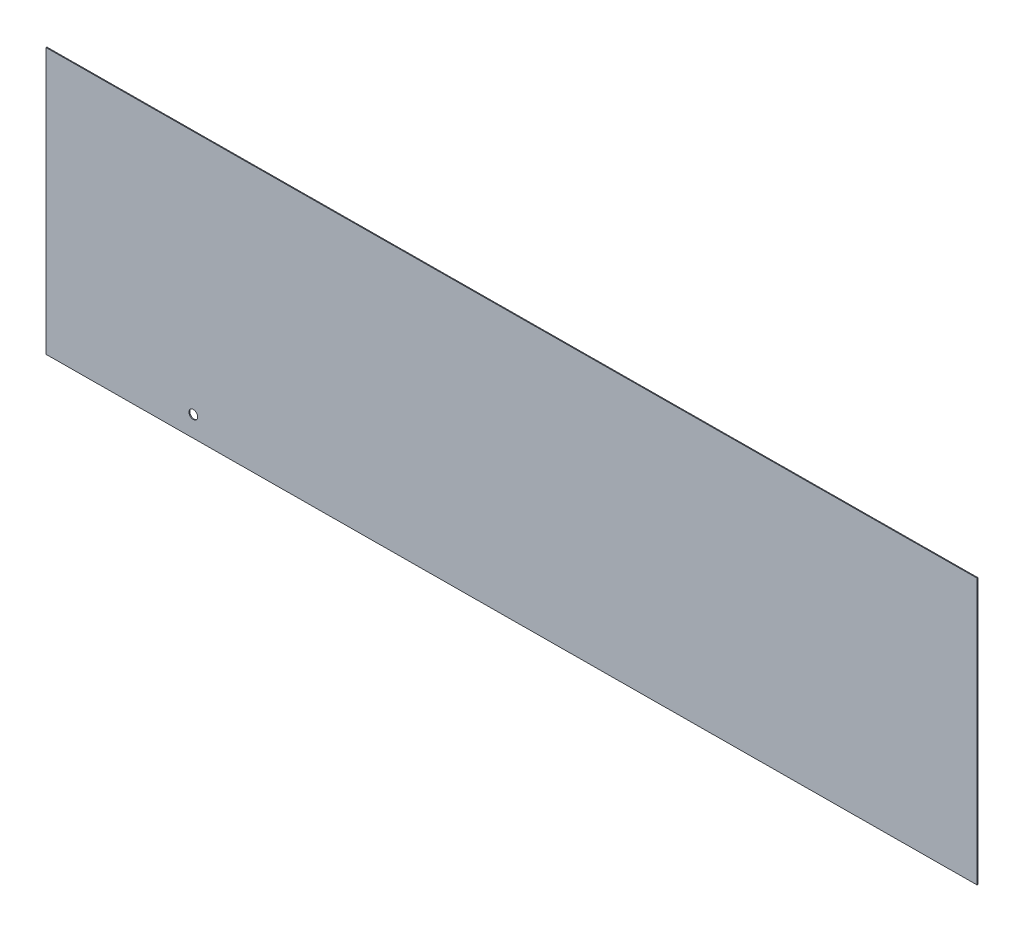
ISO-10303-21;
HEADER;
FILE_DESCRIPTION(('STEP AP214'),'2;1');
FILE_NAME('part.step','',(''),(''),'','','');
FILE_SCHEMA(('AUTOMOTIVE_DESIGN { 1 0 10303 214 1 1 1 1 }'));
ENDSEC;
DATA;
#1=APPLICATION_CONTEXT('core data for automotive mechanical design processes');
#2=APPLICATION_PROTOCOL_DEFINITION('international standard','automotive_design',2000,#1);
#3=PRODUCT_CONTEXT('',#1,'mechanical');
#4=PRODUCT('Part','Part','',(#3));
#5=PRODUCT_RELATED_PRODUCT_CATEGORY('part','',(#4));
#6=PRODUCT_DEFINITION_FORMATION('','',#4);
#7=PRODUCT_DEFINITION_CONTEXT('part definition',#1,'design');
#8=PRODUCT_DEFINITION('design','',#6,#7);
#9=PRODUCT_DEFINITION_SHAPE('','',#8);
#10=(LENGTH_UNIT() NAMED_UNIT(*) SI_UNIT(.MILLI.,.METRE.));
#11=(NAMED_UNIT(*) PLANE_ANGLE_UNIT() SI_UNIT($,.RADIAN.));
#12=(NAMED_UNIT(*) SI_UNIT($,.STERADIAN.) SOLID_ANGLE_UNIT());
#13=UNCERTAINTY_MEASURE_WITH_UNIT(LENGTH_MEASURE(1.E-05),#10,'distance_accuracy_value','');
#14=(GEOMETRIC_REPRESENTATION_CONTEXT(3) GLOBAL_UNCERTAINTY_ASSIGNED_CONTEXT((#13)) GLOBAL_UNIT_ASSIGNED_CONTEXT((#10,
#11,#12)) REPRESENTATION_CONTEXT('',''));
#15=CARTESIAN_POINT('',(0.,0.,0.));
#16=DIRECTION('',(0.,0.,1.));
#17=DIRECTION('',(1.,0.,0.));
#18=AXIS2_PLACEMENT_3D('',#15,#16,#17);
#19=CARTESIAN_POINT('',(-4.99352331606251,731.,-770.983829094289));
#20=DIRECTION('',(0.999979026062632,0.,-0.00647668393782393));
#21=DIRECTION('',(0.,1.,0.));
#22=AXIS2_PLACEMENT_3D('',#19,#20,#21);
#23=PLANE('',#22);
#24=DIRECTION('',(0.00647668393782393,0.,0.999979026062632));
#25=VECTOR('',#24,1.);
#26=CARTESIAN_POINT('',(-4.99352331606273,1041.,-770.983829094289));
#27=LINE('',#26,#25);
#28=CARTESIAN_POINT('',(-5.000000000001,1041.,-771.983808120352));
#29=VERTEX_POINT('',#28);
#30=CARTESIAN_POINT('',(-4.98704663212535,1041.,-769.983850068227));
#31=VERTEX_POINT('',#30);
#32=EDGE_CURVE('E11',#29,#31,#27,.T.);
#33=ORIENTED_EDGE('',*,*,#32,.F.);
#34=DIRECTION('',(0.,1.,0.));
#35=VECTOR('',#34,1.);
#36=CARTESIAN_POINT('',(-5.000000000001,731.,-771.983808120352));
#37=LINE('',#36,#35);
#38=CARTESIAN_POINT('',(-5.000000000001,421.,-771.983808120352));
#39=VERTEX_POINT('',#38);
#40=EDGE_CURVE('E78',#29,#39,#37,.F.);
#41=ORIENTED_EDGE('',*,*,#40,.T.);
#42=DIRECTION('',(0.00647668393782393,0.,0.999979026062632));
#43=VECTOR('',#42,1.);
#44=CARTESIAN_POINT('',(-4.99352331606273,421.,-770.983829094289));
#45=LINE('',#44,#43);
#46=CARTESIAN_POINT('',(-4.98704663212535,421.,-769.983850068227));
#47=VERTEX_POINT('',#46);
#48=EDGE_CURVE('E50',#39,#47,#45,.T.);
#49=ORIENTED_EDGE('',*,*,#48,.T.);
#50=DIRECTION('',(0.,1.,0.));
#51=VECTOR('',#50,1.);
#52=CARTESIAN_POINT('',(-4.98704663212535,731.,-769.983850068227));
#53=LINE('',#52,#51);
#54=EDGE_CURVE('E80',#31,#47,#53,.F.);
#55=ORIENTED_EDGE('',*,*,#54,.F.);
#56=EDGE_LOOP('',(#33,#41,#49,#55));
#57=FACE_BOUND('',#56,.T.);
#58=ADVANCED_FACE('F40',(#57),#23,.F.);
#59=CARTESIAN_POINT('',(1074.28637945939,421.,-777.974130519156));
#60=DIRECTION('',(0.,-1.,0.));
#61=DIRECTION('',(0.999979026062632,0.,-0.00647668393782393));
#62=AXIS2_PLACEMENT_3D('',#59,#60,#61);
#63=PLANE('',#62);
#64=ORIENTED_EDGE('',*,*,#48,.F.);
#65=DIRECTION('',(0.999979026062632,0.,-0.00647668393782393));
#66=VECTOR('',#65,1.);
#67=CARTESIAN_POINT('',(1074.27990277545,421.,-778.974109545218));
#68=LINE('',#67,#66);
#69=CARTESIAN_POINT('',(2153.55980555091,421.,-785.964410970084));
#70=VERTEX_POINT('',#69);
#71=EDGE_CURVE('E92',#39,#70,#68,.T.);
#72=ORIENTED_EDGE('',*,*,#71,.T.);
#73=DIRECTION('',(0.00647668393782393,0.,0.999979026062632));
#74=VECTOR('',#73,1.);
#75=CARTESIAN_POINT('',(2153.56628223484,421.,-784.964431944022));
#76=LINE('',#75,#74);
#77=CARTESIAN_POINT('',(2153.57275891878,421.,-783.964452917959));
#78=VERTEX_POINT('',#77);
#79=EDGE_CURVE('E107',#70,#78,#76,.T.);
#80=ORIENTED_EDGE('',*,*,#79,.T.);
#81=DIRECTION('',(0.999979026062632,0.,-0.00647668393782393));
#82=VECTOR('',#81,1.);
#83=CARTESIAN_POINT('',(1074.29285614333,421.,-776.974151493093));
#84=LINE('',#83,#82);
#85=EDGE_CURVE('E101',#47,#78,#84,.T.);
#86=ORIENTED_EDGE('',*,*,#85,.F.);
#87=EDGE_LOOP('',(#64,#72,#80,#86));
#88=FACE_BOUND('',#87,.T.);
#89=ADVANCED_FACE('F115',(#88),#63,.T.);
#90=CARTESIAN_POINT('',(2153.56628223484,731.,-784.964431944022));
#91=DIRECTION('',(0.999979026062632,0.,-0.00647668393782393));
#92=DIRECTION('',(0.,1.,0.));
#93=AXIS2_PLACEMENT_3D('',#90,#91,#92);
#94=PLANE('',#93);
#95=ORIENTED_EDGE('',*,*,#79,.F.);
#96=DIRECTION('',(0.,1.,0.));
#97=VECTOR('',#96,1.);
#98=CARTESIAN_POINT('',(2153.55980555091,731.,-785.964410970084));
#99=LINE('',#98,#97);
#100=CARTESIAN_POINT('',(2153.55980555091,1041.,-785.964410970084));
#101=VERTEX_POINT('',#100);
#102=EDGE_CURVE('E97',#70,#101,#99,.T.);
#103=ORIENTED_EDGE('',*,*,#102,.T.);
#104=DIRECTION('',(0.00647668393782393,0.,0.999979026062632));
#105=VECTOR('',#104,1.);
#106=CARTESIAN_POINT('',(2153.56628223484,1041.,-784.964431944022));
#107=LINE('',#106,#105);
#108=CARTESIAN_POINT('',(2153.57275891878,1041.,-783.964452917959));
#109=VERTEX_POINT('',#108);
#110=EDGE_CURVE('E44',#101,#109,#107,.T.);
#111=ORIENTED_EDGE('',*,*,#110,.T.);
#112=DIRECTION('',(0.,1.,0.));
#113=VECTOR('',#112,1.);
#114=CARTESIAN_POINT('',(2153.57275891878,731.,-783.964452917959));
#115=LINE('',#114,#113);
#116=EDGE_CURVE('E117',#78,#109,#115,.T.);
#117=ORIENTED_EDGE('',*,*,#116,.F.);
#118=EDGE_LOOP('',(#95,#103,#111,#117));
#119=FACE_BOUND('',#118,.T.);
#120=ADVANCED_FACE('F170',(#119),#94,.T.);
#121=CARTESIAN_POINT('',(1074.28637945939,1041.,-777.974130519156));
#122=DIRECTION('',(0.,-1.,0.));
#123=DIRECTION('',(0.999979026062632,0.,-0.00647668393782393));
#124=AXIS2_PLACEMENT_3D('',#121,#122,#123);
#125=PLANE('',#124);
#126=DIRECTION('',(0.999979026062632,0.,-0.00647668393782393));
#127=VECTOR('',#126,1.);
#128=CARTESIAN_POINT('',(1074.27990277545,1041.,-778.974109545218));
#129=LINE('',#128,#127);
#130=EDGE_CURVE('E90',#101,#29,#129,.F.);
#131=ORIENTED_EDGE('',*,*,#130,.T.);
#132=ORIENTED_EDGE('',*,*,#32,.T.);
#133=DIRECTION('',(0.999979026062632,0.,-0.00647668393782393));
#134=VECTOR('',#133,1.);
#135=CARTESIAN_POINT('',(1074.29285614333,1041.,-776.974151493093));
#136=LINE('',#135,#134);
#137=EDGE_CURVE('E114',#109,#31,#136,.F.);
#138=ORIENTED_EDGE('',*,*,#137,.F.);
#139=ORIENTED_EDGE('',*,*,#110,.F.);
#140=EDGE_LOOP('',(#131,#132,#138,#139));
#141=FACE_BOUND('',#140,.T.);
#142=ADVANCED_FACE('F42',(#141),#125,.F.);
#143=CARTESIAN_POINT('',(1074.29285614333,731.,-776.974151493093));
#144=DIRECTION('',(0.00647668393782393,0.,0.999979026062632));
#145=DIRECTION('',(0.999979026062632,0.,-0.00647668393782393));
#146=AXIS2_PLACEMENT_3D('',#143,#144,#145);
#147=PLANE('',#146);
#148=CARTESIAN_POINT('',(326.298369520536,469.000000019268,-772.129526005131));
#149=CARTESIAN_POINT('',(326.298368741562,468.716596190719,-772.129526000085));
#150=CARTESIAN_POINT('',(326.31047383022,468.433223587765,-772.129604402563));
#151=CARTESIAN_POINT('',(326.358481168548,467.868470945542,-772.129915337442));
#152=CARTESIAN_POINT('',(326.394386189566,467.587091142178,-772.130147887792));
#153=CARTESIAN_POINT('',(326.48964283208,467.028070182548,-772.130764847899));
#154=CARTESIAN_POINT('',(326.549012628228,466.750432097218,-772.131149375369));
#155=CARTESIAN_POINT('',(326.655354230811,466.338409158912,-772.131838130764));
#156=CARTESIAN_POINT('',(326.693704450376,466.201744672794,-772.132086518225));
#157=CARTESIAN_POINT('',(326.776135289892,465.930119822499,-772.132620407917));
#158=CARTESIAN_POINT('',(326.820216891253,465.79515975453,-772.132905916505));
#159=CARTESIAN_POINT('',(326.913990900652,465.527401319176,-772.133513273864));
#160=CARTESIAN_POINT('',(326.963675872169,465.394600348186,-772.13383507447));
#161=CARTESIAN_POINT('',(327.068662413671,465.131233535084,-772.134515053379));
#162=CARTESIAN_POINT('',(327.123964464851,465.000667885586,-772.134873234798));
#163=CARTESIAN_POINT('',(327.298155624472,464.612593289192,-772.136001439547));
#164=CARTESIAN_POINT('',(327.425317817518,464.358740716878,-772.136825046154));
#165=CARTESIAN_POINT('',(327.700461521874,463.862641405457,-772.138607102341));
#166=CARTESIAN_POINT('',(327.848442413607,463.620394321251,-772.139565547908));
#167=CARTESIAN_POINT('',(328.164108135141,463.149129210306,-772.141610057898));
#168=CARTESIAN_POINT('',(328.331791205221,462.920110004826,-772.142696110924));
#169=CARTESIAN_POINT('',(328.685929563762,462.476725188146,-772.14498980125));
#170=CARTESIAN_POINT('',(328.872399669902,462.262371371094,-772.146197534522));
#171=CARTESIAN_POINT('',(329.165186342337,461.953335485263,-772.148093861034));
#172=CARTESIAN_POINT('',(329.264972152954,461.852397090532,-772.148740155746));
#173=CARTESIAN_POINT('',(329.468752279647,461.654861928496,-772.150060002902));
#174=CARTESIAN_POINT('',(329.572746609055,461.558265174947,-772.150733555432));
#175=CARTESIAN_POINT('',(329.890694836921,461.275210014085,-772.152792848804));
#176=CARTESIAN_POINT('',(330.110664172003,461.095433790814,-772.154217550545));
#177=CARTESIAN_POINT('',(330.56486989641,460.754907865878,-772.157159359166));
#178=CARTESIAN_POINT('',(330.799108467564,460.594161085014,-772.158676480177));
#179=CARTESIAN_POINT('',(331.280329340794,460.292701706276,-772.161793261049));
#180=CARTESIAN_POINT('',(331.527318466004,460.151999989627,-772.163392965101));
#181=CARTESIAN_POINT('',(332.032147923001,459.891910809876,-772.166662654515));
#182=CARTESIAN_POINT('',(332.289983552297,459.772514225277,-772.168332609419));
#183=CARTESIAN_POINT('',(332.814921782634,459.556078222993,-772.171732539734));
#184=CARTESIAN_POINT('',(333.082025871679,459.459042414503,-772.173462524782));
#185=CARTESIAN_POINT('',(333.623460496503,459.287739694629,-772.17696929927));
#186=CARTESIAN_POINT('',(333.897791771754,459.213475123058,-772.178746093501));
#187=CARTESIAN_POINT('',(334.451915229071,459.088051979188,-772.182335051271));
#188=CARTESIAN_POINT('',(334.731711760467,459.036912662783,-772.184147242981));
#189=CARTESIAN_POINT('',(335.294621659973,458.958220486202,-772.187793108953));
#190=CARTESIAN_POINT('',(335.577734779159,458.930665867251,-772.189626781604));
#191=CARTESIAN_POINT('',(336.003328680974,458.907315794096,-772.192383276607));
#192=CARTESIAN_POINT('',(336.145366289595,458.902529971728,-772.1933032286));
#193=CARTESIAN_POINT('',(336.429516240208,458.899010234261,-772.195143616621));
#194=CARTESIAN_POINT('',(336.571628581926,458.9002762972,-772.196064052648));
#195=CARTESIAN_POINT('',(336.997691526643,458.913119591414,-772.198823585556));
#196=CARTESIAN_POINT('',(337.281419630823,458.933739108825,-772.200661241354));
#197=CARTESIAN_POINT('',(337.846323040511,458.998696785394,-772.204320018933));
#198=CARTESIAN_POINT('',(338.127496241889,459.043052959785,-772.206141127086));
#199=CARTESIAN_POINT('',(338.685159668371,459.155113509748,-772.209753012599));
#200=CARTESIAN_POINT('',(338.961649908156,459.222817812106,-772.211543790053));
#201=CARTESIAN_POINT('',(339.507997613217,459.381178513364,-772.215082385677));
#202=CARTESIAN_POINT('',(339.777854765704,459.471835992373,-772.216830201821));
#203=CARTESIAN_POINT('',(340.308871227472,459.675784399732,-772.220269499745));
#204=CARTESIAN_POINT('',(340.570030844101,459.789074527317,-772.221960983516));
#205=CARTESIAN_POINT('',(341.081961031133,460.037397834207,-772.225276663078));
#206=CARTESIAN_POINT('',(341.332726041295,460.172442466351,-772.226900822857));
#207=CARTESIAN_POINT('',(341.822077340925,460.463070212316,-772.230070263036));
#208=CARTESIAN_POINT('',(342.060662790955,460.61865473914,-772.231615537998));
#209=CARTESIAN_POINT('',(342.523970350289,460.949265484775,-772.234616297563));
#210=CARTESIAN_POINT('',(342.748692181152,461.124292093869,-772.236071780363));
#211=CARTESIAN_POINT('',(343.182558203986,461.492669225478,-772.238881852403));
#212=CARTESIAN_POINT('',(343.391703778719,461.686018117983,-772.240236450599));
#213=CARTESIAN_POINT('',(343.792800764867,462.089962039609,-772.242834283493));
#214=CARTESIAN_POINT('',(343.984744675952,462.300564515824,-772.244077469613));
#215=CARTESIAN_POINT('',(344.350196176364,462.737205199367,-772.246444433121));
#216=CARTESIAN_POINT('',(344.523703095427,462.963243967379,-772.247568206166));
#217=CARTESIAN_POINT('',(344.851146331362,463.429071429521,-772.249688996994));
#218=CARTESIAN_POINT('',(345.005082357473,463.668860327855,-772.250686012894));
#219=CARTESIAN_POINT('',(345.292261206108,464.160547365958,-772.252546018542));
#220=CARTESIAN_POINT('',(345.425505665433,464.412444545837,-772.253409018892));
#221=CARTESIAN_POINT('',(345.608903265848,464.797902239839,-772.254596852098));
#222=CARTESIAN_POINT('',(345.667273057148,464.927609152064,-772.254974902717));
#223=CARTESIAN_POINT('',(345.77840854075,465.189399165473,-772.255694707215));
#224=CARTESIAN_POINT('',(345.831174348783,465.32148221752,-772.256036461845));
#225=CARTESIAN_POINT('',(345.980963725166,465.720924563413,-772.257006620641));
#226=CARTESIAN_POINT('',(346.069499961855,465.991520620924,-772.25758005389));
#227=CARTESIAN_POINT('',(346.223482864196,466.539145840717,-772.258577373398));
#228=CARTESIAN_POINT('',(346.288930696794,466.816174677116,-772.259001267215));
#229=CARTESIAN_POINT('',(346.396362001548,467.374752048697,-772.259697080415));
#230=CARTESIAN_POINT('',(346.438345748222,467.656300530962,-772.259969001576));
#231=CARTESIAN_POINT('',(346.498388767764,468.221251171871,-772.260357889393));
#232=CARTESIAN_POINT('',(346.516505887146,468.504647169275,-772.26047523071));
#233=CARTESIAN_POINT('',(346.528514846804,469.071947364053,-772.260553010577));
#234=CARTESIAN_POINT('',(346.522407476617,469.355851544561,-772.260513454241));
#235=CARTESIAN_POINT('',(346.486204699973,469.922103070043,-772.260278975381));
#236=CARTESIAN_POINT('',(346.456110445261,470.204450489109,-772.260084060317));
#237=CARTESIAN_POINT('',(346.372384210104,470.765649013539,-772.259541780581));
#238=CARTESIAN_POINT('',(346.318750689558,471.044499888907,-772.259194405934));
#239=CARTESIAN_POINT('',(346.188415874309,471.596379024927,-772.258350250824));
#240=CARTESIAN_POINT('',(346.111744427889,471.86941433307,-772.257853663683));
#241=CARTESIAN_POINT('',(345.935690123631,472.408044917483,-772.256713391683));
#242=CARTESIAN_POINT('',(345.836309288419,472.673640853983,-772.256069719923));
#243=CARTESIAN_POINT('',(345.615286002424,473.195406332052,-772.254638191932));
#244=CARTESIAN_POINT('',(345.493643088325,473.451575677303,-772.2538503327));
#245=CARTESIAN_POINT('',(345.229279561098,473.952800838633,-772.252138097777));
#246=CARTESIAN_POINT('',(345.086558153812,474.197856235526,-772.251213716943));
#247=CARTESIAN_POINT('',(344.781130117711,474.675239616492,-772.249235514597));
#248=CARTESIAN_POINT('',(344.618419225813,474.907564870326,-772.248181665473));
#249=CARTESIAN_POINT('',(344.274123988099,475.357805951718,-772.245951727267));
#250=CARTESIAN_POINT('',(344.092541113899,475.575722900655,-772.244775647715));
#251=CARTESIAN_POINT('',(343.806909936932,475.890485694702,-772.242925666058));
#252=CARTESIAN_POINT('',(343.709475860366,475.993401076797,-772.242294603103));
#253=CARTESIAN_POINT('',(343.510316911439,476.194988785305,-772.241004686483));
#254=CARTESIAN_POINT('',(343.408592125937,476.293661197529,-772.24034583338));
#255=CARTESIAN_POINT('',(343.097284520023,476.583085044009,-772.238329550119));
#256=CARTESIAN_POINT('',(342.88153674636,476.767278001952,-772.236932190671));
#257=CARTESIAN_POINT('',(342.435109857298,477.11719590731,-772.234040764165));
#258=CARTESIAN_POINT('',(342.204410035474,477.282894339703,-772.232546562995));
#259=CARTESIAN_POINT('',(341.729978106198,477.594457057413,-772.22947375289));
#260=CARTESIAN_POINT('',(341.486246122592,477.740321531165,-772.227895144757));
#261=CARTESIAN_POINT('',(340.987404468605,478.011133595466,-772.224664237264));
#262=CARTESIAN_POINT('',(340.732294224564,478.136080129877,-772.223011934189));
#263=CARTESIAN_POINT('',(340.212383772569,478.363842978078,-772.219644567889));
#264=CARTESIAN_POINT('',(339.947583839448,478.466659918973,-772.217929506443));
#265=CARTESIAN_POINT('',(339.409728699068,478.64978723795,-772.21444591563));
#266=CARTESIAN_POINT('',(339.136657989924,478.730052030644,-772.212677285859));
#267=CARTESIAN_POINT('',(338.584745736276,478.867464309798,-772.209102649657));
#268=CARTESIAN_POINT('',(338.305903817834,478.924610293341,-772.207296640803));
#269=CARTESIAN_POINT('',(337.744407535597,479.015389067929,-772.203659930575));
#270=CARTESIAN_POINT('',(337.461753051865,479.049021117489,-772.201829228423));
#271=CARTESIAN_POINT('',(336.894630529343,479.092355859861,-772.19815607805));
#272=CARTESIAN_POINT('',(336.610162646474,479.102060582896,-772.196313630839));
#273=CARTESIAN_POINT('',(336.040845424373,479.097198870959,-772.192626265792));
#274=CARTESIAN_POINT('',(335.755996518829,479.082582019403,-772.190781350766));
#275=CARTESIAN_POINT('',(335.188535846363,479.029426387806,-772.187106010257));
#276=CARTESIAN_POINT('',(334.905924161741,478.990886731827,-772.185275585308));
#277=CARTESIAN_POINT('',(334.344924226954,478.890275202906,-772.181642089832));
#278=CARTESIAN_POINT('',(334.066536077976,478.828202767093,-772.179839019962));
#279=CARTESIAN_POINT('',(333.515935442126,478.680899671175,-772.176272878871));
#280=CARTESIAN_POINT('',(333.243722460369,478.595670874,-772.174509804446));
#281=CARTESIAN_POINT('',(332.841546852269,478.450760293195,-772.171904985511));
#282=CARTESIAN_POINT('',(332.708464035042,478.399590035143,-772.171043032088));
#283=CARTESIAN_POINT('',(332.444611443295,478.291604665988,-772.169334106402));
#284=CARTESIAN_POINT('',(332.313841624128,478.23478966398,-772.168487133851));
#285=CARTESIAN_POINT('',(331.925329856467,478.056078587418,-772.165970813148));
#286=CARTESIAN_POINT('',(331.671341672272,477.925900596005,-772.164325777452));
#287=CARTESIAN_POINT('',(331.175263086448,477.64468440968,-772.161112765854));
#288=CARTESIAN_POINT('',(330.933171802955,477.493647764098,-772.15954478424));
#289=CARTESIAN_POINT('',(330.462505527205,477.17179986667,-772.156496363595));
#290=CARTESIAN_POINT('',(330.233930259694,477.000989017736,-772.155015922781));
#291=CARTESIAN_POINT('',(329.792449261712,476.641097780892,-772.15215652992));
#292=CARTESIAN_POINT('',(329.579511142175,476.452057146663,-772.150777368094));
#293=CARTESIAN_POINT('',(329.170543938728,476.056495406491,-772.14812856122));
#294=CARTESIAN_POINT('',(328.974514535499,475.849974630806,-772.146858914104));
#295=CARTESIAN_POINT('',(328.600589868891,475.421066370815,-772.144437071426));
#296=CARTESIAN_POINT('',(328.422697925259,475.198675994471,-772.143284897366));
#297=CARTESIAN_POINT('',(328.086183152569,474.739754617131,-772.14110535183));
#298=CARTESIAN_POINT('',(327.927561062282,474.503223074506,-772.140077985138));
#299=CARTESIAN_POINT('',(327.630969363031,474.01809969747,-772.138157014153));
#300=CARTESIAN_POINT('',(327.49296493613,473.769529156057,-772.13726318435));
#301=CARTESIAN_POINT('',(327.238447014667,473.261611705987,-772.135614717641));
#302=CARTESIAN_POINT('',(327.121933326963,473.002264894204,-772.134860079484));
#303=CARTESIAN_POINT('',(326.911581902685,472.474853062932,-772.133497671218));
#304=CARTESIAN_POINT('',(326.817719953329,472.206797703139,-772.132889744288));
#305=CARTESIAN_POINT('',(326.652875551093,471.663827579785,-772.131822076802));
#306=CARTESIAN_POINT('',(326.581888525722,471.388914198933,-772.131362306632));
#307=CARTESIAN_POINT('',(326.448337727978,470.764814301161,-772.130497322183));
#308=CARTESIAN_POINT('',(326.392296590659,470.414213038654,-772.130134353837));
#309=CARTESIAN_POINT('',(326.31731357849,469.709058151476,-772.12964870238));
#310=CARTESIAN_POINT('',(326.298370494939,469.354504655952,-772.129526011442));
#311=CARTESIAN_POINT('',(326.298369520536,469.000000019268,-772.129526005131));
#312=B_SPLINE_CURVE_WITH_KNOTS('',3,(#148,#149,#150,#151,#152,#153,#154,#155,#156,#157,#158,
#159,#160,#161,#162,#163,#164,#165,#166,#167,#168,#169,#170,#171,#172,#173,#174,#175,#176,#177,
#178,#179,#180,#181,#182,#183,#184,#185,#186,#187,#188,#189,#190,#191,#192,#193,#194,#195,#196,
#197,#198,#199,#200,#201,#202,#203,#204,#205,#206,#207,#208,#209,#210,#211,#212,#213,#214,#215,
#216,#217,#218,#219,#220,#221,#222,#223,#224,#225,#226,#227,#228,#229,#230,#231,#232,#233,#234,
#235,#236,#237,#238,#239,#240,#241,#242,#243,#244,#245,#246,#247,#248,#249,#250,#251,#252,#253,
#254,#255,#256,#257,#258,#259,#260,#261,#262,#263,#264,#265,#266,#267,#268,#269,#270,#271,#272,
#273,#274,#275,#276,#277,#278,#279,#280,#281,#282,#283,#284,#285,#286,#287,#288,#289,#290,#291,
#292,#293,#294,#295,#296,#297,#298,#299,#300,#301,#302,#303,#304,#305,#306,#307,#308,#309,#310,
#311),.UNSPECIFIED.,.T.,.F.,(4,2,2,2,2,2,2,2,2,2,2,2,2,2,2,2,2,2,2,2,2,2,2,2,2,2,2,2,2,2,2,2,2,
2,2,2,2,2,2,2,2,2,2,2,2,2,2,2,2,2,2,2,2,2,2,2,2,2,2,2,2,2,2,2,2,2,2,2,2,2,2,2,2,2,2,2,2,2,2,2,2,
4),(0.,0.84990364938927,1.69990628197103,2.55056857878089,2.97629597882303,3.40209637430182,
3.82733817448585,4.25261643446223,5.10328075431259,5.95391976316251,6.80448285396182,
7.65572213074444,8.08142185630815,8.50712293050545,9.35830697496943,10.2096214975622,
11.0613963995478,11.912805746279,12.764352420662,13.6159865646867,14.4683285458866,
15.3206069601204,15.7468594758194,16.1731104446942,17.0254579107573,17.8784531959406,
18.7314458063933,19.5844785636233,20.4374811450672,21.290934273191,22.1444461436177,
22.9979751506874,23.8514282962231,24.705251774998,25.5591062832805,26.4129734755635,
27.2667730884915,27.6933685570845,28.1199552139667,28.972984261193,29.825970188036,
30.6789461351659,31.5298508627777,32.3807278575494,33.2315639994101,34.0824558171433,
34.9322499256848,35.7819683762915,36.6317045131364,37.4814726729562,38.3314223753088,
39.1813058492153,39.6063636559246,40.031412862245,40.8813702534768,41.732530960676,
42.5836835807185,43.4348791621122,44.2860506192594,45.1389303984737,45.9918656131335,
46.8448277228506,47.6977174565634,48.5523773626175,49.4070685640385,50.2617802096942,
51.1164231140693,51.5440621653452,51.9716929532606,52.8268148975116,53.6818733594969,
54.5369144021834,55.3901312995062,56.2433320803678,57.0966887455513,57.9500781165599,
58.8020096336261,59.6539334938419,60.5049426459183,61.3557815832405,62.4189450663424,
63.4820739096811),.UNSPECIFIED.);
#313=CARTESIAN_POINT('',(346.524759079806,469.,-772.260528685151));
#314=VERTEX_POINT('',#313);
#315=EDGE_CURVE('E94',#314,#314,#312,.F.);
#316=ORIENTED_EDGE('',*,*,#315,.T.);
#317=EDGE_LOOP('',(#316));
#318=FACE_BOUND('',#317,.T.);
#319=ORIENTED_EDGE('',*,*,#116,.T.);
#320=ORIENTED_EDGE('',*,*,#137,.T.);
#321=ORIENTED_EDGE('',*,*,#54,.T.);
#322=ORIENTED_EDGE('',*,*,#85,.T.);
#323=EDGE_LOOP('',(#319,#320,#321,#322));
#324=FACE_BOUND('',#323,.T.);
#325=ADVANCED_FACE('F113',(#318,#324),#147,.T.);
#326=CARTESIAN_POINT('',(1074.27990277545,731.,-778.974109545218));
#327=DIRECTION('',(0.00647668393782393,0.,0.999979026062632));
#328=DIRECTION('',(0.999979026062632,0.,-0.00647668393782393));
#329=AXIS2_PLACEMENT_3D('',#326,#327,#328);
#330=PLANE('',#329);
#331=CARTESIAN_POINT('',(326.311617635815,469.000000016112,-774.12965375954));
#332=CARTESIAN_POINT('',(326.311616882755,469.284117303382,-774.129653754663));
#333=CARTESIAN_POINT('',(326.323747251555,469.568203650324,-774.129732320876));
#334=CARTESIAN_POINT('',(326.371863155835,470.134378752352,-774.130043958916));
#335=CARTESIAN_POINT('',(326.407851403232,470.416467276662,-774.130277048309));
#336=CARTESIAN_POINT('',(326.503340245225,470.976896282313,-774.13089551233));
#337=CARTESIAN_POINT('',(326.562859105807,471.255233677796,-774.131281005263));
#338=CARTESIAN_POINT('',(326.669479069192,471.66829256564,-774.131971563551));
#339=CARTESIAN_POINT('',(326.707931507194,471.805301052877,-774.132220613062));
#340=CARTESIAN_POINT('',(326.790585766529,472.077607944852,-774.132755949805));
#341=CARTESIAN_POINT('',(326.834788574287,472.21290605181,-774.133042243424));
#342=CARTESIAN_POINT('',(326.928826810198,472.481339200465,-774.133651312131));
#343=CARTESIAN_POINT('',(326.978655052023,472.614476758867,-774.133974040673));
#344=CARTESIAN_POINT('',(327.083948238239,472.878507806082,-774.134656005664));
#345=CARTESIAN_POINT('',(327.139413668331,473.009401100391,-774.135015245259));
#346=CARTESIAN_POINT('',(327.314122592389,473.398446297167,-774.136146803475));
#347=CARTESIAN_POINT('',(327.44166645788,473.652928530842,-774.136972882106));
#348=CARTESIAN_POINT('',(327.717653476568,474.150228332476,-774.138760400288));
#349=CARTESIAN_POINT('',(327.866095703482,474.393046416786,-774.13972183384));
#350=CARTESIAN_POINT('',(328.182785433447,474.86538045841,-774.141772976148));
#351=CARTESIAN_POINT('',(328.351030930785,475.094897759344,-774.142862671913));
#352=CARTESIAN_POINT('',(328.706065058496,475.538793650442,-774.145162163975));
#353=CARTESIAN_POINT('',(328.89283758014,475.753185119268,-774.146371855938));
#354=CARTESIAN_POINT('',(329.283977232262,476.165272596059,-774.148905196974));
#355=CARTESIAN_POINT('',(329.488344279142,476.362968683342,-774.150228845507));
#356=CARTESIAN_POINT('',(329.913082376915,476.740335281318,-774.15297979762));
#357=CARTESIAN_POINT('',(330.133453483786,476.920005728956,-774.154407101565));
#358=CARTESIAN_POINT('',(330.588488866465,477.260240616653,-774.157354283733));
#359=CARTESIAN_POINT('',(330.823153630774,477.420804403167,-774.158874165121));
#360=CARTESIAN_POINT('',(331.30461952727,477.72138027354,-774.161992532964));
#361=CARTESIAN_POINT('',(331.551394464717,477.861434312977,-774.16359084976));
#362=CARTESIAN_POINT('',(332.05588159157,478.120255447407,-774.166858321963));
#363=CARTESIAN_POINT('',(332.313593964268,478.239022185489,-774.168527478557));
#364=CARTESIAN_POINT('',(332.838203109904,478.454122569575,-774.171925277449));
#365=CARTESIAN_POINT('',(333.105099529122,478.550457078443,-774.173653917457));
#366=CARTESIAN_POINT('',(333.64605550846,478.720317157722,-774.177157591845));
#367=CARTESIAN_POINT('',(333.920115275023,478.793842069992,-774.178932627563));
#368=CARTESIAN_POINT('',(334.47298910244,478.917593754775,-774.182513491706));
#369=CARTESIAN_POINT('',(334.751795154018,478.967856387371,-774.184319268256));
#370=CARTESIAN_POINT('',(335.312655671001,479.04485459592,-774.187951860747));
#371=CARTESIAN_POINT('',(335.594709873127,479.071592065294,-774.189778674983));
#372=CARTESIAN_POINT('',(336.018666873619,479.093754582528,-774.192524568071));
#373=CARTESIAN_POINT('',(336.160150630479,479.098150866829,-774.193440932866));
#374=CARTESIAN_POINT('',(336.443174802314,479.100904175138,-774.195274029421));
#375=CARTESIAN_POINT('',(336.584715216325,479.099261298047,-774.196190761175));
#376=CARTESIAN_POINT('',(337.009041475039,479.085316806285,-774.198939045881));
#377=CARTESIAN_POINT('',(337.291581079797,479.064001865998,-774.200769003983));
#378=CARTESIAN_POINT('',(337.853713756482,478.997774543338,-774.204409836023));
#379=CARTESIAN_POINT('',(338.133308049863,478.952872370236,-774.206220717874));
#380=CARTESIAN_POINT('',(338.68777526043,478.839865292502,-774.209811902071));
#381=CARTESIAN_POINT('',(338.962648210134,478.771760547745,-774.21159220463));
#382=CARTESIAN_POINT('',(339.505737907457,478.612748968919,-774.215109698725));
#383=CARTESIAN_POINT('',(339.773954338171,478.521841051518,-774.216846888209));
#384=CARTESIAN_POINT('',(340.301680477187,478.317546746712,-774.220264875306));
#385=CARTESIAN_POINT('',(340.56119047638,478.204161111189,-774.221945674803));
#386=CARTESIAN_POINT('',(341.069988516742,477.95574498636,-774.225241068016));
#387=CARTESIAN_POINT('',(341.319264691146,477.820690213657,-774.226855584873));
#388=CARTESIAN_POINT('',(341.805661383759,477.530196316196,-774.230005888594));
#389=CARTESIAN_POINT('',(342.042781065588,477.374755791484,-774.23154167004));
#390=CARTESIAN_POINT('',(342.503206518661,477.044594348676,-774.234523762723));
#391=CARTESIAN_POINT('',(342.726511925953,476.86987292294,-774.235970071602));
#392=CARTESIAN_POINT('',(343.157620961834,476.50227310128,-774.238762287134));
#393=CARTESIAN_POINT('',(343.365425936649,476.309396285466,-774.240108202505));
#394=CARTESIAN_POINT('',(343.764347780441,475.906156833008,-774.242691947395));
#395=CARTESIAN_POINT('',(343.955422485999,475.695752485626,-774.243929503828));
#396=CARTESIAN_POINT('',(344.319189866212,475.259606840012,-774.246285559592));
#397=CARTESIAN_POINT('',(344.491881826994,475.03386494672,-774.2474040543));
#398=CARTESIAN_POINT('',(344.817774005978,474.568728686397,-774.249514799212));
#399=CARTESIAN_POINT('',(344.970973766442,474.329333998946,-774.250507046451));
#400=CARTESIAN_POINT('',(345.256783666337,473.838531700749,-774.252358185665));
#401=CARTESIAN_POINT('',(345.389395363913,473.587125000983,-774.253217087731));
#402=CARTESIAN_POINT('',(345.572090803783,473.202157702361,-774.25440037317));
#403=CARTESIAN_POINT('',(345.630328375047,473.072411581104,-774.254777567424));
#404=CARTESIAN_POINT('',(345.741208224066,472.810552945934,-774.255495716223));
#405=CARTESIAN_POINT('',(345.793850615355,472.6784404801,-774.255836671504));
#406=CARTESIAN_POINT('',(345.943283196347,472.278923183235,-774.256804519401));
#407=CARTESIAN_POINT('',(346.03159939929,472.008294998745,-774.257376527531));
#408=CARTESIAN_POINT('',(346.185187441088,471.460632185714,-774.258371289599));
#409=CARTESIAN_POINT('',(346.250460203941,471.183597814523,-774.25879404952));
#410=CARTESIAN_POINT('',(346.35759486314,470.625031914947,-774.259487941401));
#411=CARTESIAN_POINT('',(346.399456995388,470.343500431908,-774.259759074887));
#412=CARTESIAN_POINT('',(346.459380100024,469.77803498054,-774.260147186036));
#413=CARTESIAN_POINT('',(346.477451510547,469.494102120879,-774.260264231305));
#414=CARTESIAN_POINT('',(346.489347855432,468.925733132749,-774.260341281787));
#415=CARTESIAN_POINT('',(346.483173519845,468.641297019689,-774.260301291729));
#416=CARTESIAN_POINT('',(346.44681289188,468.073984795486,-774.260065790494));
#417=CARTESIAN_POINT('',(346.416627594052,467.791108620216,-774.25987028576));
#418=CARTESIAN_POINT('',(346.332685278352,467.228860537898,-774.259326606509));
#419=CARTESIAN_POINT('',(346.278926766887,466.949488854047,-774.258978422318));
#420=CARTESIAN_POINT('',(346.148255682535,466.39638660016,-774.258132089254));
#421=CARTESIAN_POINT('',(346.071356823498,466.122652791285,-774.257634029203));
#422=CARTESIAN_POINT('',(345.894765823564,465.5826549915,-774.256490281121));
#423=CARTESIAN_POINT('',(345.795075652077,465.316390357407,-774.255844605846));
#424=CARTESIAN_POINT('',(345.573359786762,464.793325549255,-774.254408592144));
#425=CARTESIAN_POINT('',(345.451333676163,464.536525551906,-774.253618251017));
#426=CARTESIAN_POINT('',(345.186124743759,464.034089619043,-774.251900540557));
#427=CARTESIAN_POINT('',(345.042941183554,463.788454073561,-774.250973166442));
#428=CARTESIAN_POINT('',(344.736659462936,463.310234387543,-774.248989434935));
#429=CARTESIAN_POINT('',(344.57357818689,463.077639422615,-774.2479331869));
#430=CARTESIAN_POINT('',(344.228482715065,462.626922420818,-774.245698065721));
#431=CARTESIAN_POINT('',(344.046470045871,462.408799219299,-774.244519202465));
#432=CARTESIAN_POINT('',(343.760144853956,462.093794137771,-774.242664725798));
#433=CARTESIAN_POINT('',(343.662471660311,461.990809613796,-774.242032114125));
#434=CARTESIAN_POINT('',(343.462819183491,461.789106829699,-774.240739001013));
#435=CARTESIAN_POINT('',(343.360839984137,461.690388486608,-774.240078500118));
#436=CARTESIAN_POINT('',(343.048751541672,461.40085880858,-774.23805715952));
#437=CARTESIAN_POINT('',(342.832459863469,461.216638095925,-774.2366562773));
#438=CARTESIAN_POINT('',(342.385429060829,460.867192074389,-774.233760939354));
#439=CARTESIAN_POINT('',(342.154704050563,460.7019486429,-774.232266575043));
#440=CARTESIAN_POINT('',(341.680237263115,460.391336276643,-774.229193539168));
#441=CARTESIAN_POINT('',(341.436495695668,460.245967021776,-774.227614868962));
#442=CARTESIAN_POINT('',(340.937646897499,459.976209504749,-774.224383915198));
#443=CARTESIAN_POINT('',(340.682539203601,459.851822098599,-774.222731628639));
#444=CARTESIAN_POINT('',(340.162648510307,459.625258231986,-774.219364390313));
#445=CARTESIAN_POINT('',(339.897865758734,459.523081203078,-774.21764944015));
#446=CARTESIAN_POINT('',(339.360765073941,459.341527526155,-774.214170735809));
#447=CARTESIAN_POINT('',(339.088451285257,459.262138600582,-774.212407008475));
#448=CARTESIAN_POINT('',(338.538118929283,459.126436243029,-774.208842604985));
#449=CARTESIAN_POINT('',(338.260100014355,459.070124221638,-774.207041926577));
#450=CARTESIAN_POINT('',(337.70031409703,458.980976588954,-774.203416294074));
#451=CARTESIAN_POINT('',(337.418547001863,458.948141559831,-774.201591339378));
#452=CARTESIAN_POINT('',(336.853261295924,458.906378693227,-774.197930085735));
#453=CARTESIAN_POINT('',(336.569742837553,458.897448804122,-774.196093787776));
#454=CARTESIAN_POINT('',(336.002821520883,458.903819658853,-774.192421940577));
#455=CARTESIAN_POINT('',(335.719418816929,458.919134013725,-774.190586392338));
#456=CARTESIAN_POINT('',(335.154903519397,458.973556022193,-774.186930128491));
#457=CARTESIAN_POINT('',(334.873791010505,459.012664551637,-774.185109413433));
#458=CARTESIAN_POINT('',(334.315831185106,459.114281876058,-774.181495608198));
#459=CARTESIAN_POINT('',(334.038983965498,459.176791201839,-774.179702518649));
#460=CARTESIAN_POINT('',(333.491494660477,459.324829331158,-774.176156529088));
#461=CARTESIAN_POINT('',(333.220852067397,459.410356244036,-774.174403625787));
#462=CARTESIAN_POINT('',(332.821024121705,459.555614730151,-774.171814012239));
#463=CARTESIAN_POINT('',(332.688713097774,459.60688893142,-774.170957057582));
#464=CARTESIAN_POINT('',(332.426406717278,459.715046597185,-774.169258146427));
#465=CARTESIAN_POINT('',(332.296411316598,459.771929954683,-774.168416189645));
#466=CARTESIAN_POINT('',(331.910221910773,459.950788349345,-774.165914910461));
#467=CARTESIAN_POINT('',(331.657781389574,460.080987465145,-774.1642798987));
#468=CARTESIAN_POINT('',(331.164774193167,460.362085110642,-774.161086779937));
#469=CARTESIAN_POINT('',(330.924206673623,460.512982165533,-774.159528667468));
#470=CARTESIAN_POINT('',(330.456539948182,460.834381873313,-774.156499674369));
#471=CARTESIAN_POINT('',(330.229440480814,461.004884145393,-774.155028792046));
#472=CARTESIAN_POINT('',(329.790519142026,461.364241451451,-774.152185977636));
#473=CARTESIAN_POINT('',(329.578686555095,461.553083390277,-774.150813976147));
#474=CARTESIAN_POINT('',(329.171874878575,461.948120953975,-774.148179130233));
#475=CARTESIAN_POINT('',(328.976895477491,462.154316257966,-774.14691628379));
#476=CARTESIAN_POINT('',(328.604991551034,462.582450890933,-774.144507529082));
#477=CARTESIAN_POINT('',(328.428070514808,462.804393248485,-774.143361643415));
#478=CARTESIAN_POINT('',(328.093395218356,463.262297519445,-774.141194011835));
#479=CARTESIAN_POINT('',(327.935641724866,463.49825999312,-774.140172270887));
#480=CARTESIAN_POINT('',(327.640297488932,463.982718753893,-774.138259379497));
#481=CARTESIAN_POINT('',(327.502721277625,464.231223902449,-774.13736832317));
#482=CARTESIAN_POINT('',(327.249004724279,464.738953054174,-774.135725046779));
#483=CARTESIAN_POINT('',(327.13286423668,464.998176984541,-774.134972825771));
#484=CARTESIAN_POINT('',(326.923202722465,465.525250594391,-774.133614885928));
#485=CARTESIAN_POINT('',(326.82965414784,465.793089312756,-774.133008988669));
#486=CARTESIAN_POINT('',(326.665324509811,466.335672422375,-774.131944655219));
#487=CARTESIAN_POINT('',(326.594546334095,466.610417684742,-774.13148623773));
#488=CARTESIAN_POINT('',(326.461291840978,467.234495951597,-774.130623172393));
#489=CARTESIAN_POINT('',(326.405356119266,467.585244527668,-774.130260886804));
#490=CARTESIAN_POINT('',(326.330520013297,468.290678217879,-774.129776186833));
#491=CARTESIAN_POINT('',(326.311618575789,468.645363219779,-774.129653765628));
#492=CARTESIAN_POINT('',(326.311617635815,469.000000016112,-774.12965375954));
#493=B_SPLINE_CURVE_WITH_KNOTS('',3,(#331,#332,#333,#334,#335,#336,#337,#338,#339,#340,#341,
#342,#343,#344,#345,#346,#347,#348,#349,#350,#351,#352,#353,#354,#355,#356,#357,#358,#359,#360,
#361,#362,#363,#364,#365,#366,#367,#368,#369,#370,#371,#372,#373,#374,#375,#376,#377,#378,#379,
#380,#381,#382,#383,#384,#385,#386,#387,#388,#389,#390,#391,#392,#393,#394,#395,#396,#397,#398,
#399,#400,#401,#402,#403,#404,#405,#406,#407,#408,#409,#410,#411,#412,#413,#414,#415,#416,#417,
#418,#419,#420,#421,#422,#423,#424,#425,#426,#427,#428,#429,#430,#431,#432,#433,#434,#435,#436,
#437,#438,#439,#440,#441,#442,#443,#444,#445,#446,#447,#448,#449,#450,#451,#452,#453,#454,#455,
#456,#457,#458,#459,#460,#461,#462,#463,#464,#465,#466,#467,#468,#469,#470,#471,#472,#473,#474,
#475,#476,#477,#478,#479,#480,#481,#482,#483,#484,#485,#486,#487,#488,#489,#490,#491,#492),
.UNSPECIFIED.,.T.,.F.,(4,2,2,2,2,2,2,2,2,2,2,2,2,2,2,2,2,2,2,2,2,2,2,2,2,2,2,2,2,2,2,2,2,2,2,2,
2,2,2,2,2,2,2,2,2,2,2,2,2,2,2,2,2,2,2,2,2,2,2,2,2,2,2,2,2,2,2,2,2,2,2,2,2,2,2,2,2,2,2,2,4),(0.,
0.852043884984269,1.70418463814227,2.55698818107427,2.98379162370115,3.41066837737271,
3.83700585055772,4.26338008822383,5.11623940982674,5.96906094191139,6.8217961728576,
7.67379636713039,8.52579251341515,9.37779163992566,10.229819900787,11.0800801121259,
11.9303545778914,12.7805963321212,13.6308626166941,14.4798137670452,15.3286965833751,
15.7532505282214,16.1777975203644,17.0267455541018,17.875326439757,18.7239014784235,
19.5725168388117,20.4211038177852,21.270648489746,22.1202515331683,22.9698769507943,
23.8194284915891,24.6710628831114,25.5227303348737,26.3744177827269,27.2260407417173,
27.6525812311265,28.0791130637697,28.9320329255139,29.7849185829387,30.6377956459365,
31.4902983858389,32.3427754566481,33.195217219113,34.0477129999008,34.8997045509676,
35.7516225088214,36.6035563644044,37.455519959673,38.3067655776358,39.1579426062194,
39.5836434669443,40.0093360448696,40.8605808180115,41.7110058025368,42.5614170882918,
43.4118630604245,44.2622872639367,45.1122524202294,45.962269523371,46.8123077041075,
47.6622729292871,48.5127155053635,49.3631893875938,50.2136825624436,51.0641058992723,
51.4896977569112,51.9152814976247,52.7663111623436,53.6172802195061,54.4682327503552,
55.3185820778055,56.1689156848975,57.0194132793951,57.8699448841428,58.7210860423906,
59.5722214207184,60.422313645574,61.2725136346309,62.3360698530771,63.3995958236705),.UNSPECIFIED.);
#494=CARTESIAN_POINT('',(346.485604228493,469.,-774.26031703499));
#495=VERTEX_POINT('',#494);
#496=EDGE_CURVE('E129',#495,#495,#493,.F.);
#497=ORIENTED_EDGE('',*,*,#496,.T.);
#498=EDGE_LOOP('',(#497));
#499=FACE_BOUND('',#498,.T.);
#500=ORIENTED_EDGE('',*,*,#102,.F.);
#501=ORIENTED_EDGE('',*,*,#71,.F.);
#502=ORIENTED_EDGE('',*,*,#40,.F.);
#503=ORIENTED_EDGE('',*,*,#130,.F.);
#504=EDGE_LOOP('',(#500,#501,#502,#503));
#505=FACE_BOUND('',#504,.T.);
#506=ADVANCED_FACE('F89',(#499,#505),#330,.F.);
#507=CARTESIAN_POINT('',(346.524759079806,469.,-772.260528685151));
#508=CARTESIAN_POINT('',(346.485604228493,469.,-774.26031703499));
#509=CARTESIAN_POINT('',(346.524759077237,467.677223786008,-772.260528685135));
#510=CARTESIAN_POINT('',(346.485604225992,467.67898874074,-774.260317034974));
#511=CARTESIAN_POINT('',(346.261048297617,466.354387413524,-772.25882067794));
#512=CARTESIAN_POINT('',(346.223368605977,466.357917403369,-774.258618582123));
#513=CARTESIAN_POINT('',(345.246896548063,463.910942221684,-772.252252199827));
#514=CARTESIAN_POINT('',(345.213939696533,463.916304703205,-774.252080692993));
#515=CARTESIAN_POINT('',(344.496401958929,462.790203435708,-772.247391381626));
#516=CARTESIAN_POINT('',(344.466691329894,462.795634154938,-774.24724089999));
#517=CARTESIAN_POINT('',(342.623914175316,460.92142297654,-772.235263615707));
#518=CARTESIAN_POINT('',(342.600289910944,460.925616756052,-774.235152554358));
#519=CARTESIAN_POINT('',(341.501781023107,460.173240059666,-772.227995761508));
#520=CARTESIAN_POINT('',(341.480995508617,460.176130418975,-774.227903086231));
#521=CARTESIAN_POINT('',(339.057018966558,459.162555897888,-772.212161478257));
#522=CARTESIAN_POINT('',(339.040736991306,459.163348568768,-774.212097971593));
#523=CARTESIAN_POINT('',(336.411562407758,458.637455564359,-772.195027332884));
#524=CARTESIAN_POINT('',(336.398609043445,458.63666292966,-774.194985385033));
#525=CARTESIAN_POINT('',(333.76610603753,459.162556867118,-772.177893188732));
#526=CARTESIAN_POINT('',(333.756481284519,459.16334953825,-774.177872799696));
#527=CARTESIAN_POINT('',(331.321344751393,460.173241738711,-772.162058910472));
#528=CARTESIAN_POINT('',(331.316223536421,460.176132099131,-774.16206769004));
#529=CARTESIAN_POINT('',(330.199212182559,460.921424745106,-772.154791060051));
#530=CARTESIAN_POINT('',(330.196929717343,460.92561852517,-774.15481822569));
#531=CARTESIAN_POINT('',(328.326725142599,462.790205363685,-772.142663298949));
#532=CARTESIAN_POINT('',(328.330529041212,462.795636082538,-774.142729884869));
#533=CARTESIAN_POINT('',(327.576230816614,463.910944353813,-772.137802482452));
#534=CARTESIAN_POINT('',(327.583280936832,463.916306833802,-774.137890093564));
#535=CARTESIAN_POINT('',(326.562079693093,466.354389708637,-772.131234008393));
#536=CARTESIAN_POINT('',(326.573852652247,466.357919692935,-774.131352208482));
#537=CARTESIAN_POINT('',(326.0346707755,469.000002181214,-772.127818075882));
#538=CARTESIAN_POINT('',(326.049393983304,469.000002174516,-774.127955384201));
#539=CARTESIAN_POINT('',(326.56208081633,471.645614420494,-772.131234015668));
#540=CARTESIAN_POINT('',(326.573853768556,471.642084425742,-774.131352215713));
#541=CARTESIAN_POINT('',(327.576232903297,474.089059220139,-772.137802495967));
#542=CARTESIAN_POINT('',(327.583283014121,474.083696736304,-774.137890107019));
#543=CARTESIAN_POINT('',(328.326727619537,475.20979781175,-772.142663314992));
#544=CARTESIAN_POINT('',(328.330531508149,475.204367091895,-774.142729900847));
#545=CARTESIAN_POINT('',(330.199215586132,477.078577901789,-772.154791082096));
#546=CARTESIAN_POINT('',(330.196933110873,477.074384123444,-774.154818247669));
#547=CARTESIAN_POINT('',(331.321348802411,477.826760630811,-772.162058936709));
#548=CARTESIAN_POINT('',(331.316227577782,477.823870272828,-774.162067716215));
#549=CARTESIAN_POINT('',(333.766110700159,478.837444352899,-772.177893218931));
#550=CARTESIAN_POINT('',(333.756485935415,478.836651682023,-774.177872829819));
#551=CARTESIAN_POINT('',(336.411566990709,479.362544391311,-772.195027362567));
#552=CARTESIAN_POINT('',(336.398613615294,479.363337025959,-774.194985414643));
#553=CARTESIAN_POINT('',(339.057023048649,478.837442997441,-772.212161504696));
#554=CARTESIAN_POINT('',(339.040741062113,478.836650326547,-774.212097997958));
#555=CARTESIAN_POINT('',(341.501784705247,477.826757816201,-772.227995785357));
#556=CARTESIAN_POINT('',(341.480999180728,477.823867455423,-774.227903110015));
#557=CARTESIAN_POINT('',(342.623917593162,477.078574398355,-772.235263637843));
#558=CARTESIAN_POINT('',(342.600293318623,477.07438061715,-774.235152576429));
#559=CARTESIAN_POINT('',(344.49640457122,475.209793131651,-772.247391398545));
#560=CARTESIAN_POINT('',(344.466693932502,475.204362412609,-774.247240916847));
#561=CARTESIAN_POINT('',(345.246898658085,474.089054055314,-772.252252213493));
#562=CARTESIAN_POINT('',(345.213941797614,474.083691576099,-774.252080706602));
#563=CARTESIAN_POINT('',(346.261048857252,471.645609792803,-772.258820681565));
#564=CARTESIAN_POINT('',(346.223369162262,471.642079806913,-774.258618585726));
#565=CARTESIAN_POINT('',(346.524759082376,470.322774833336,-772.260528685168));
#566=CARTESIAN_POINT('',(346.485604230994,470.321009880447,-774.260317035007));
#567=CARTESIAN_POINT('',(346.524759079806,469.,-772.260528685151));
#568=CARTESIAN_POINT('',(346.485604228493,469.,-774.26031703499));
#569=B_SPLINE_SURFACE_WITH_KNOTS('',3,1,((#507,#508),(#509,#510),(#511,#512),(#513,#514),(#515,
#516),(#517,#518),(#519,#520),(#521,#522),(#523,#524),(#525,#526),(#527,#528),(#529,#530),(#531,
#532),(#533,#534),(#535,#536),(#537,#538),(#539,#540),(#541,#542),(#543,#544),(#545,#546),(#547,
#548),(#549,#550),(#551,#552),(#553,#554),(#555,#556),(#557,#558),(#559,#560),(#561,#562),(#563,
#564),(#565,#566),(#567,#568)),.UNSPECIFIED.,.T.,.F.,.F.,(4,1,1,1,1,1,1,1,1,1,1,1,1,1,1,1,1,1,1,
1,1,1,1,1,1,1,1,1,4),(2,2),(0.,0.0624985287870085,0.0625013702568312,0.124997965326408,
0.125001983084603,0.187498602608762,0.187501443458632,0.250000028891778,0.312498613659731,
0.312501454668321,0.374998054244649,0.375002072783209,0.437498667787213,0.437501509416169,
0.500000033926072,0.562498556107441,0.562501397505548,0.624997988649088,0.625002006368441,
0.687498623741228,0.68750146453604,0.750000037335675,0.812498621318976,0.812501462423339,
0.874998084114125,0.875002102133322,0.937498694708296,0.937501536446186,1.),(0.,1.),.UNSPECIFIED.);
#570=CARTESIAN_POINT('',(346.524759079806,469.,-772.260528685151));
#571=CARTESIAN_POINT('',(346.524351216772,469.,-772.281359813795));
#572=CARTESIAN_POINT('',(346.523943353737,469.,-772.30219094244));
#573=CARTESIAN_POINT('',(346.523127627668,469.,-772.343853199728));
#574=CARTESIAN_POINT('',(346.522719764634,469.,-772.364684328372));
#575=CARTESIAN_POINT('',(346.521904038565,469.,-772.40634658566));
#576=CARTESIAN_POINT('',(346.52149617553,469.,-772.427177714304));
#577=CARTESIAN_POINT('',(346.520680449461,469.,-772.468839971593));
#578=CARTESIAN_POINT('',(346.520272586427,469.,-772.489671100237));
#579=CARTESIAN_POINT('',(346.519456860358,469.,-772.531333357525));
#580=CARTESIAN_POINT('',(346.519048997323,469.,-772.552164486169));
#581=CARTESIAN_POINT('',(346.518233271254,469.,-772.593826743458));
#582=CARTESIAN_POINT('',(346.51782540822,469.,-772.614657872102));
#583=CARTESIAN_POINT('',(346.517009682151,469.,-772.65632012939));
#584=CARTESIAN_POINT('',(346.516601819116,469.,-772.677151258034));
#585=CARTESIAN_POINT('',(346.515786093047,469.,-772.718813515323));
#586=CARTESIAN_POINT('',(346.515378230013,469.,-772.739644643967));
#587=CARTESIAN_POINT('',(346.514562503944,469.,-772.781306901255));
#588=CARTESIAN_POINT('',(346.514154640909,469.,-772.802138029899));
#589=CARTESIAN_POINT('',(346.51333891484,469.,-772.843800287188));
#590=CARTESIAN_POINT('',(346.512931051806,469.,-772.864631415832));
#591=CARTESIAN_POINT('',(346.512115325736,469.,-772.90629367312));
#592=CARTESIAN_POINT('',(346.511707462702,469.,-772.927124801764));
#593=CARTESIAN_POINT('',(346.510891736633,469.,-772.968787059053));
#594=CARTESIAN_POINT('',(346.510483873598,469.,-772.989618187697));
#595=CARTESIAN_POINT('',(346.509668147529,469.,-773.031280444985));
#596=CARTESIAN_POINT('',(346.509260284495,469.,-773.052111573629));
#597=CARTESIAN_POINT('',(346.508444558426,469.,-773.093773830917));
#598=CARTESIAN_POINT('',(346.508036695391,469.,-773.114604959562));
#599=CARTESIAN_POINT('',(346.507220969322,469.,-773.15626721685));
#600=CARTESIAN_POINT('',(346.506813106288,469.,-773.177098345494));
#601=CARTESIAN_POINT('',(346.505997380219,469.,-773.218760602782));
#602=CARTESIAN_POINT('',(346.505589517184,469.,-773.239591731427));
#603=CARTESIAN_POINT('',(346.504773791115,469.,-773.281253988715));
#604=CARTESIAN_POINT('',(346.504365928081,469.,-773.302085117359));
#605=CARTESIAN_POINT('',(346.503550202012,469.,-773.343747374647));
#606=CARTESIAN_POINT('',(346.503142338977,469.,-773.364578503292));
#607=CARTESIAN_POINT('',(346.502326612908,469.,-773.40624076058));
#608=CARTESIAN_POINT('',(346.501918749874,469.,-773.427071889224));
#609=CARTESIAN_POINT('',(346.501103023805,469.,-773.468734146512));
#610=CARTESIAN_POINT('',(346.50069516077,469.,-773.489565275157));
#611=CARTESIAN_POINT('',(346.499879434701,469.,-773.531227532445));
#612=CARTESIAN_POINT('',(346.499471571667,469.,-773.552058661089));
#613=CARTESIAN_POINT('',(346.498655845598,469.,-773.593720918377));
#614=CARTESIAN_POINT('',(346.498247982563,469.,-773.614552047022));
#615=CARTESIAN_POINT('',(346.497432256494,469.,-773.65621430431));
#616=CARTESIAN_POINT('',(346.497024393459,469.,-773.677045432954));
#617=CARTESIAN_POINT('',(346.49620866739,469.,-773.718707690242));
#618=CARTESIAN_POINT('',(346.495800804356,469.,-773.739538818886));
#619=CARTESIAN_POINT('',(346.494985078287,469.,-773.781201076175));
#620=CARTESIAN_POINT('',(346.494577215252,469.,-773.802032204819));
#621=CARTESIAN_POINT('',(346.493761489183,469.,-773.843694462107));
#622=CARTESIAN_POINT('',(346.493353626149,469.,-773.864525590751));
#623=CARTESIAN_POINT('',(346.49253790008,469.,-773.90618784804));
#624=CARTESIAN_POINT('',(346.492130037045,469.,-773.927018976684));
#625=CARTESIAN_POINT('',(346.491314310976,469.,-773.968681233972));
#626=CARTESIAN_POINT('',(346.490906447942,469.,-773.989512362616));
#627=CARTESIAN_POINT('',(346.490090721873,469.,-774.031174619905));
#628=CARTESIAN_POINT('',(346.489682858838,469.,-774.052005748549));
#629=CARTESIAN_POINT('',(346.488867132769,469.,-774.093668005837));
#630=CARTESIAN_POINT('',(346.488459269735,469.,-774.114499134481));
#631=CARTESIAN_POINT('',(346.487643543666,469.,-774.15616139177));
#632=CARTESIAN_POINT('',(346.487235680631,469.,-774.176992520414));
#633=CARTESIAN_POINT('',(346.486419954562,469.,-774.218654777702));
#634=CARTESIAN_POINT('',(346.486012091528,469.,-774.239485906346));
#635=CARTESIAN_POINT('',(346.485604228493,469.,-774.26031703499));
#636=B_SPLINE_CURVE_WITH_KNOTS('',3,(#570,#571,#572,#573,#574,#575,#576,#577,#578,#579,#580,
#581,#582,#583,#584,#585,#586,#587,#588,#589,#590,#591,#592,#593,#594,#595,#596,#597,#598,#599,
#600,#601,#602,#603,#604,#605,#606,#607,#608,#609,#610,#611,#612,#613,#614,#615,#616,#617,#618,
#619,#620,#621,#622,#623,#624,#625,#626,#627,#628,#629,#630,#631,#632,#633,#634,#635),
.UNSPECIFIED.,.F.,.F.,(4,2,2,2,2,2,2,2,2,2,2,2,2,2,2,2,2,2,2,2,2,2,2,2,2,2,2,2,2,2,2,2,4),(0.,
0.0625053634146412,0.125010726829393,0.187516090243923,0.250021453658676,0.312526817073317,
0.375032180487958,0.437537543902601,0.500042907317241,0.562548270731882,0.625053634146634,
0.687558997561276,0.750064360976029,0.812569724390557,0.87507508780531,0.937580451219951,
1.00008581463459,1.06259117804935,1.12509654146388,1.18760190487863,1.25010726829327,
1.31261263170791,1.37511799512266,1.43762335853731,1.50012872195195,1.56263408536659,
1.62513944878134,1.68764481219598,1.75015017561062,1.81265553902526,1.87516090244001,
1.93766626585455,2.0001716292693),.UNSPECIFIED.);
#637=EDGE_CURVE('',#314,#495,#636,.T.);
#638=ORIENTED_EDGE('',*,*,#315,.F.);
#639=ORIENTED_EDGE('',*,*,#496,.F.);
#640=ORIENTED_EDGE('',*,*,#637,.T.);
#641=ORIENTED_EDGE('',*,*,#637,.F.);
#642=EDGE_LOOP('',(#638,#640,#639,#641));
#643=FACE_BOUND('',#642,.T.);
#644=ADVANCED_FACE('F148',(#643),#569,.F.);
#645=CLOSED_SHELL('',(#58,#89,#120,#142,#325,#506,#644));
#646=MANIFOLD_SOLID_BREP('B2',#645);
#647=ADVANCED_BREP_SHAPE_REPRESENTATION('',(#18,#646),#14);
#648=SHAPE_DEFINITION_REPRESENTATION(#9,#647);
ENDSEC;
END-ISO-10303-21;
